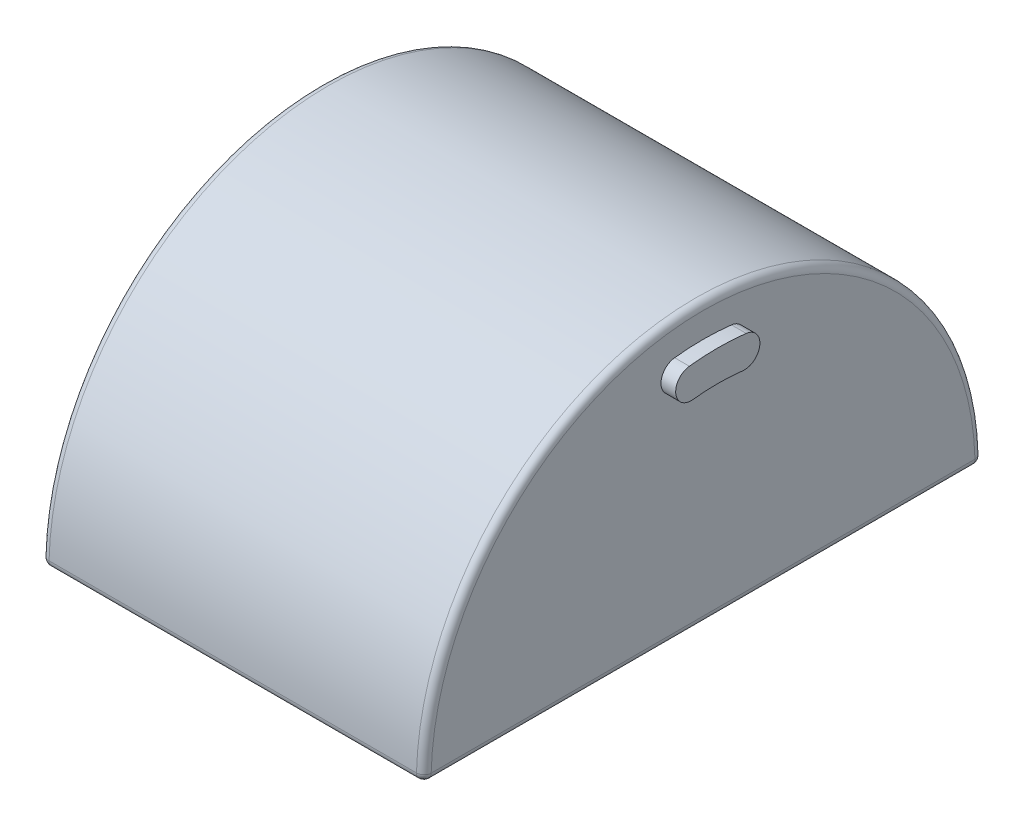
ISO-10303-21;
HEADER;
FILE_DESCRIPTION(('STEP AP214'),'2;1');
FILE_NAME('part.step','',(''),(''),'','','');
FILE_SCHEMA(('AUTOMOTIVE_DESIGN { 1 0 10303 214 1 1 1 1 }'));
ENDSEC;
DATA;
#1=APPLICATION_CONTEXT('core data for automotive mechanical design processes');
#2=APPLICATION_PROTOCOL_DEFINITION('international standard','automotive_design',2000,#1);
#3=PRODUCT_CONTEXT('',#1,'mechanical');
#4=PRODUCT('Part','Part','',(#3));
#5=PRODUCT_RELATED_PRODUCT_CATEGORY('part','',(#4));
#6=PRODUCT_DEFINITION_FORMATION('','',#4);
#7=PRODUCT_DEFINITION_CONTEXT('part definition',#1,'design');
#8=PRODUCT_DEFINITION('design','',#6,#7);
#9=PRODUCT_DEFINITION_SHAPE('','',#8);
#10=(LENGTH_UNIT() NAMED_UNIT(*) SI_UNIT(.MILLI.,.METRE.));
#11=(NAMED_UNIT(*) PLANE_ANGLE_UNIT() SI_UNIT($,.RADIAN.));
#12=(NAMED_UNIT(*) SI_UNIT($,.STERADIAN.) SOLID_ANGLE_UNIT());
#13=UNCERTAINTY_MEASURE_WITH_UNIT(LENGTH_MEASURE(1.E-05),#10,'distance_accuracy_value','');
#14=(GEOMETRIC_REPRESENTATION_CONTEXT(3) GLOBAL_UNCERTAINTY_ASSIGNED_CONTEXT((#13)) GLOBAL_UNIT_ASSIGNED_CONTEXT((#10,
#11,#12)) REPRESENTATION_CONTEXT('',''));
#15=CARTESIAN_POINT('',(0.,0.,0.));
#16=DIRECTION('',(0.,0.,1.));
#17=DIRECTION('',(1.,0.,0.));
#18=AXIS2_PLACEMENT_3D('',#15,#16,#17);
#19=CARTESIAN_POINT('',(-17.78,3.95516952522712E-13,0.));
#20=DIRECTION('',(1.,0.,0.));
#21=DIRECTION('',(0.,0.,-1.));
#22=AXIS2_PLACEMENT_3D('',#19,#20,#21);
#23=CYLINDRICAL_SURFACE('',#22,18.6773538171098);
#24=CARTESIAN_POINT('',(-16.51,3.95516952522712E-13,0.));
#25=DIRECTION('',(1.,0.,0.));
#26=DIRECTION('',(0.,0.,-1.));
#27=AXIS2_PLACEMENT_3D('',#24,#25,#26);
#28=CIRCLE('',#27,18.6773538171098);
#29=CARTESIAN_POINT('',(-16.51,18.5531588532219,-2.15031211144726));
#30=VERTEX_POINT('',#29);
#31=CARTESIAN_POINT('',(-16.51,18.5531588532219,2.15031211144719));
#32=VERTEX_POINT('',#31);
#33=EDGE_CURVE('E108',#30,#32,#28,.T.);
#34=ORIENTED_EDGE('',*,*,#33,.T.);
#35=DIRECTION('',(1.,0.,0.));
#36=VECTOR('',#35,1.);
#37=CARTESIAN_POINT('',(-17.78,18.5531588532219,2.15031211144719));
#38=LINE('',#37,#36);
#39=CARTESIAN_POINT('',(-17.78,18.5531588532219,2.15031211144719));
#40=VERTEX_POINT('',#39);
#41=EDGE_CURVE('E12',#40,#32,#38,.T.);
#42=ORIENTED_EDGE('',*,*,#41,.F.);
#43=CARTESIAN_POINT('',(-17.78,3.95516952522712E-13,0.));
#44=DIRECTION('',(1.,0.,0.));
#45=DIRECTION('',(0.,0.,-1.));
#46=AXIS2_PLACEMENT_3D('',#43,#44,#45);
#47=CIRCLE('',#46,18.6773538171098);
#48=CARTESIAN_POINT('',(-17.78,18.5531588532219,-2.15031211144726));
#49=VERTEX_POINT('',#48);
#50=EDGE_CURVE('E85',#49,#40,#47,.T.);
#51=ORIENTED_EDGE('',*,*,#50,.F.);
#52=DIRECTION('',(1.,0.,0.));
#53=VECTOR('',#52,1.);
#54=CARTESIAN_POINT('',(-17.78,18.5531588532219,-2.15031211144726));
#55=LINE('',#54,#53);
#56=EDGE_CURVE('E61',#49,#30,#55,.T.);
#57=ORIENTED_EDGE('',*,*,#56,.T.);
#58=EDGE_LOOP('',(#34,#42,#51,#57));
#59=FACE_BOUND('',#58,.T.);
#60=ADVANCED_FACE('F45',(#59),#23,.F.);
#61=CARTESIAN_POINT('',(-17.78,19.8777917521343,2.30383713585338));
#62=DIRECTION('',(1.,0.,0.));
#63=DIRECTION('',(0.,0.,-1.));
#64=AXIS2_PLACEMENT_3D('',#61,#62,#63);
#65=CYLINDRICAL_SURFACE('',#64,1.3335);
#66=CARTESIAN_POINT('',(-16.51,19.8777917521343,2.30383713585338));
#67=DIRECTION('',(1.,0.,0.));
#68=DIRECTION('',(0.,0.,-1.));
#69=AXIS2_PLACEMENT_3D('',#66,#67,#68);
#70=CIRCLE('',#69,1.3335);
#71=CARTESIAN_POINT('',(-16.51,21.2024246510467,2.45736216025957));
#72=VERTEX_POINT('',#71);
#73=EDGE_CURVE('E94',#72,#32,#70,.T.);
#74=ORIENTED_EDGE('',*,*,#73,.F.);
#75=DIRECTION('',(1.,0.,0.));
#76=VECTOR('',#75,1.);
#77=CARTESIAN_POINT('',(-17.78,21.2024246510467,2.45736216025957));
#78=LINE('',#77,#76);
#79=CARTESIAN_POINT('',(-17.78,21.2024246510467,2.45736216025957));
#80=VERTEX_POINT('',#79);
#81=EDGE_CURVE('E53',#80,#72,#78,.T.);
#82=ORIENTED_EDGE('',*,*,#81,.F.);
#83=CARTESIAN_POINT('',(-17.78,19.8777917521343,2.30383713585338));
#84=DIRECTION('',(1.,0.,0.));
#85=DIRECTION('',(0.,0.,-1.));
#86=AXIS2_PLACEMENT_3D('',#83,#84,#85);
#87=CIRCLE('',#86,1.3335);
#88=EDGE_CURVE('E92',#80,#40,#87,.T.);
#89=ORIENTED_EDGE('',*,*,#88,.T.);
#90=ORIENTED_EDGE('',*,*,#41,.T.);
#91=EDGE_LOOP('',(#74,#82,#89,#90));
#92=FACE_BOUND('',#91,.T.);
#93=ADVANCED_FACE('F91',(#92),#65,.T.);
#94=CARTESIAN_POINT('',(-17.78,3.95516952522712E-13,0.));
#95=DIRECTION('',(1.,0.,0.));
#96=DIRECTION('',(0.,0.,-1.));
#97=AXIS2_PLACEMENT_3D('',#94,#95,#96);
#98=CYLINDRICAL_SURFACE('',#97,21.3443538171098);
#99=CARTESIAN_POINT('',(-16.51,3.95516952522712E-13,0.));
#100=DIRECTION('',(1.,0.,0.));
#101=DIRECTION('',(0.,0.,-1.));
#102=AXIS2_PLACEMENT_3D('',#99,#100,#101);
#103=CIRCLE('',#102,21.3443538171098);
#104=CARTESIAN_POINT('',(-16.51,21.2024246510467,-2.45736216025964));
#105=VERTEX_POINT('',#104);
#106=EDGE_CURVE('E111',#105,#72,#103,.T.);
#107=ORIENTED_EDGE('',*,*,#106,.F.);
#108=DIRECTION('',(1.,0.,0.));
#109=VECTOR('',#108,1.);
#110=CARTESIAN_POINT('',(-17.78,21.2024246510467,-2.45736216025964));
#111=LINE('',#110,#109);
#112=CARTESIAN_POINT('',(-17.78,21.2024246510467,-2.45736216025964));
#113=VERTEX_POINT('',#112);
#114=EDGE_CURVE('E74',#113,#105,#111,.T.);
#115=ORIENTED_EDGE('',*,*,#114,.F.);
#116=CARTESIAN_POINT('',(-17.78,3.95516952522712E-13,0.));
#117=DIRECTION('',(1.,0.,0.));
#118=DIRECTION('',(0.,0.,-1.));
#119=AXIS2_PLACEMENT_3D('',#116,#117,#118);
#120=CIRCLE('',#119,21.3443538171098);
#121=EDGE_CURVE('E100',#113,#80,#120,.T.);
#122=ORIENTED_EDGE('',*,*,#121,.T.);
#123=ORIENTED_EDGE('',*,*,#81,.T.);
#124=EDGE_LOOP('',(#107,#115,#122,#123));
#125=FACE_BOUND('',#124,.T.);
#126=ADVANCED_FACE('F102',(#125),#98,.T.);
#127=CARTESIAN_POINT('',(-17.78,19.8777917521343,-2.30383713585345));
#128=DIRECTION('',(1.,0.,0.));
#129=DIRECTION('',(0.,0.,-1.));
#130=AXIS2_PLACEMENT_3D('',#127,#128,#129);
#131=CYLINDRICAL_SURFACE('',#130,1.3335);
#132=CARTESIAN_POINT('',(-16.51,19.8777917521343,-2.30383713585345));
#133=DIRECTION('',(1.,0.,0.));
#134=DIRECTION('',(0.,0.,-1.));
#135=AXIS2_PLACEMENT_3D('',#132,#133,#134);
#136=CIRCLE('',#135,1.3335);
#137=EDGE_CURVE('E113',#30,#105,#136,.T.);
#138=ORIENTED_EDGE('',*,*,#137,.F.);
#139=ORIENTED_EDGE('',*,*,#56,.F.);
#140=CARTESIAN_POINT('',(-17.78,19.8777917521343,-2.30383713585345));
#141=DIRECTION('',(1.,0.,0.));
#142=DIRECTION('',(0.,0.,-1.));
#143=AXIS2_PLACEMENT_3D('',#140,#141,#142);
#144=CIRCLE('',#143,1.3335);
#145=EDGE_CURVE('E103',#49,#113,#144,.T.);
#146=ORIENTED_EDGE('',*,*,#145,.T.);
#147=ORIENTED_EDGE('',*,*,#114,.T.);
#148=EDGE_LOOP('',(#138,#139,#146,#147));
#149=FACE_BOUND('',#148,.T.);
#150=ADVANCED_FACE('F119',(#149),#131,.T.);
#151=CARTESIAN_POINT('',(-17.78,9.93889587606735,1.1519185679267));
#152=DIRECTION('',(1.,0.,0.));
#153=DIRECTION('',(0.,0.,-1.));
#154=AXIS2_PLACEMENT_3D('',#151,#152,#153);
#155=PLANE('',#154);
#156=ORIENTED_EDGE('',*,*,#50,.T.);
#157=ORIENTED_EDGE('',*,*,#88,.F.);
#158=ORIENTED_EDGE('',*,*,#121,.F.);
#159=ORIENTED_EDGE('',*,*,#145,.F.);
#160=EDGE_LOOP('',(#156,#157,#158,#159));
#161=FACE_BOUND('',#160,.T.);
#162=ADVANCED_FACE('F99',(#161),#155,.F.);
#163=CARTESIAN_POINT('',(-16.51,9.93889587606735,1.1519185679267));
#164=DIRECTION('',(1.,0.,0.));
#165=DIRECTION('',(0.,0.,-1.));
#166=AXIS2_PLACEMENT_3D('',#163,#164,#165);
#167=PLANE('',#166);
#168=ORIENTED_EDGE('',*,*,#33,.F.);
#169=ORIENTED_EDGE('',*,*,#137,.T.);
#170=ORIENTED_EDGE('',*,*,#106,.T.);
#171=ORIENTED_EDGE('',*,*,#73,.T.);
#172=EDGE_LOOP('',(#168,#169,#170,#171));
#173=FACE_BOUND('',#172,.T.);
#174=ADVANCED_FACE('F118',(#173),#167,.T.);
#175=CLOSED_SHELL('',(#60,#93,#126,#150,#162,#174));
#176=MANIFOLD_SOLID_BREP('B2',#175);
#177=CARTESIAN_POINT('',(17.78,3.95516952522712E-13,0.));
#178=DIRECTION('',(-1.,0.,0.));
#179=DIRECTION('',(0.,0.,1.));
#180=AXIS2_PLACEMENT_3D('',#177,#178,#179);
#181=CYLINDRICAL_SURFACE('',#180,18.6773538171098);
#182=CARTESIAN_POINT('',(16.51,3.95516952522712E-13,0.));
#183=DIRECTION('',(1.,0.,0.));
#184=DIRECTION('',(0.,0.,-1.));
#185=AXIS2_PLACEMENT_3D('',#182,#183,#184);
#186=CIRCLE('',#185,18.6773538171098);
#187=CARTESIAN_POINT('',(16.51,18.5531588532219,-2.15031211144726));
#188=VERTEX_POINT('',#187);
#189=CARTESIAN_POINT('',(16.51,18.5531588532219,2.15031211144719));
#190=VERTEX_POINT('',#189);
#191=EDGE_CURVE('E242',#188,#190,#186,.T.);
#192=ORIENTED_EDGE('',*,*,#191,.F.);
#193=DIRECTION('',(-1.,0.,0.));
#194=VECTOR('',#193,1.);
#195=CARTESIAN_POINT('',(17.78,18.5531588532219,-2.15031211144726));
#196=LINE('',#195,#194);
#197=CARTESIAN_POINT('',(17.78,18.5531588532219,-2.15031211144726));
#198=VERTEX_POINT('',#197);
#199=EDGE_CURVE('E43',#198,#188,#196,.T.);
#200=ORIENTED_EDGE('',*,*,#199,.F.);
#201=CARTESIAN_POINT('',(17.78,3.95516952522712E-13,0.));
#202=DIRECTION('',(1.,0.,0.));
#203=DIRECTION('',(0.,0.,-1.));
#204=AXIS2_PLACEMENT_3D('',#201,#202,#203);
#205=CIRCLE('',#204,18.6773538171098);
#206=CARTESIAN_POINT('',(17.78,18.5531588532219,2.15031211144719));
#207=VERTEX_POINT('',#206);
#208=EDGE_CURVE('E237',#198,#207,#205,.T.);
#209=ORIENTED_EDGE('',*,*,#208,.T.);
#210=DIRECTION('',(-1.,0.,0.));
#211=VECTOR('',#210,1.);
#212=CARTESIAN_POINT('',(17.78,18.5531588532219,2.15031211144719));
#213=LINE('',#212,#211);
#214=EDGE_CURVE('E180',#207,#190,#213,.T.);
#215=ORIENTED_EDGE('',*,*,#214,.T.);
#216=EDGE_LOOP('',(#192,#200,#209,#215));
#217=FACE_BOUND('',#216,.T.);
#218=ADVANCED_FACE('F177',(#217),#181,.F.);
#219=CARTESIAN_POINT('',(17.78,19.8777917521343,-2.30383713585345));
#220=DIRECTION('',(-1.,0.,0.));
#221=DIRECTION('',(0.,0.,1.));
#222=AXIS2_PLACEMENT_3D('',#219,#220,#221);
#223=CYLINDRICAL_SURFACE('',#222,1.3335);
#224=CARTESIAN_POINT('',(16.51,19.8777917521343,-2.30383713585345));
#225=DIRECTION('',(1.,0.,0.));
#226=DIRECTION('',(0.,0.,-1.));
#227=AXIS2_PLACEMENT_3D('',#224,#225,#226);
#228=CIRCLE('',#227,1.3335);
#229=CARTESIAN_POINT('',(16.51,21.2024246510467,-2.45736216025964));
#230=VERTEX_POINT('',#229);
#231=EDGE_CURVE('E210',#188,#230,#228,.T.);
#232=ORIENTED_EDGE('',*,*,#231,.T.);
#233=DIRECTION('',(-1.,0.,0.));
#234=VECTOR('',#233,1.);
#235=CARTESIAN_POINT('',(17.78,21.2024246510467,-2.45736216025964));
#236=LINE('',#235,#234);
#237=CARTESIAN_POINT('',(17.78,21.2024246510467,-2.45736216025964));
#238=VERTEX_POINT('',#237);
#239=EDGE_CURVE('E186',#238,#230,#236,.T.);
#240=ORIENTED_EDGE('',*,*,#239,.F.);
#241=CARTESIAN_POINT('',(17.78,19.8777917521343,-2.30383713585345));
#242=DIRECTION('',(1.,0.,0.));
#243=DIRECTION('',(0.,0.,-1.));
#244=AXIS2_PLACEMENT_3D('',#241,#242,#243);
#245=CIRCLE('',#244,1.3335);
#246=EDGE_CURVE('E225',#198,#238,#245,.T.);
#247=ORIENTED_EDGE('',*,*,#246,.F.);
#248=ORIENTED_EDGE('',*,*,#199,.T.);
#249=EDGE_LOOP('',(#232,#240,#247,#248));
#250=FACE_BOUND('',#249,.T.);
#251=ADVANCED_FACE('F252',(#250),#223,.T.);
#252=CARTESIAN_POINT('',(17.78,3.95516952522712E-13,0.));
#253=DIRECTION('',(-1.,0.,0.));
#254=DIRECTION('',(0.,0.,1.));
#255=AXIS2_PLACEMENT_3D('',#252,#253,#254);
#256=CYLINDRICAL_SURFACE('',#255,21.3443538171098);
#257=CARTESIAN_POINT('',(16.51,3.95516952522712E-13,0.));
#258=DIRECTION('',(1.,0.,0.));
#259=DIRECTION('',(0.,0.,-1.));
#260=AXIS2_PLACEMENT_3D('',#257,#258,#259);
#261=CIRCLE('',#260,21.3443538171098);
#262=CARTESIAN_POINT('',(16.51,21.2024246510467,2.45736216025957));
#263=VERTEX_POINT('',#262);
#264=EDGE_CURVE('E232',#230,#263,#261,.T.);
#265=ORIENTED_EDGE('',*,*,#264,.T.);
#266=DIRECTION('',(-1.,0.,0.));
#267=VECTOR('',#266,1.);
#268=CARTESIAN_POINT('',(17.78,21.2024246510467,2.45736216025957));
#269=LINE('',#268,#267);
#270=CARTESIAN_POINT('',(17.78,21.2024246510467,2.45736216025957));
#271=VERTEX_POINT('',#270);
#272=EDGE_CURVE('E229',#271,#263,#269,.T.);
#273=ORIENTED_EDGE('',*,*,#272,.F.);
#274=CARTESIAN_POINT('',(17.78,3.95516952522712E-13,0.));
#275=DIRECTION('',(1.,0.,0.));
#276=DIRECTION('',(0.,0.,-1.));
#277=AXIS2_PLACEMENT_3D('',#274,#275,#276);
#278=CIRCLE('',#277,21.3443538171098);
#279=EDGE_CURVE('E222',#238,#271,#278,.T.);
#280=ORIENTED_EDGE('',*,*,#279,.F.);
#281=ORIENTED_EDGE('',*,*,#239,.T.);
#282=EDGE_LOOP('',(#265,#273,#280,#281));
#283=FACE_BOUND('',#282,.T.);
#284=ADVANCED_FACE('F230',(#283),#256,.T.);
#285=CARTESIAN_POINT('',(17.78,19.8777917521343,2.30383713585338));
#286=DIRECTION('',(-1.,0.,0.));
#287=DIRECTION('',(0.,0.,1.));
#288=AXIS2_PLACEMENT_3D('',#285,#286,#287);
#289=CYLINDRICAL_SURFACE('',#288,1.3335);
#290=CARTESIAN_POINT('',(16.51,19.8777917521343,2.30383713585338));
#291=DIRECTION('',(1.,0.,0.));
#292=DIRECTION('',(0.,0.,-1.));
#293=AXIS2_PLACEMENT_3D('',#290,#291,#292);
#294=CIRCLE('',#293,1.3335);
#295=EDGE_CURVE('E245',#263,#190,#294,.T.);
#296=ORIENTED_EDGE('',*,*,#295,.T.);
#297=ORIENTED_EDGE('',*,*,#214,.F.);
#298=CARTESIAN_POINT('',(17.78,19.8777917521343,2.30383713585338));
#299=DIRECTION('',(1.,0.,0.));
#300=DIRECTION('',(0.,0.,-1.));
#301=AXIS2_PLACEMENT_3D('',#298,#299,#300);
#302=CIRCLE('',#301,1.3335);
#303=EDGE_CURVE('E219',#271,#207,#302,.T.);
#304=ORIENTED_EDGE('',*,*,#303,.F.);
#305=ORIENTED_EDGE('',*,*,#272,.T.);
#306=EDGE_LOOP('',(#296,#297,#304,#305));
#307=FACE_BOUND('',#306,.T.);
#308=ADVANCED_FACE('F236',(#307),#289,.T.);
#309=CARTESIAN_POINT('',(17.78,9.93889587606735,1.1519185679267));
#310=DIRECTION('',(1.,0.,0.));
#311=DIRECTION('',(0.,0.,-1.));
#312=AXIS2_PLACEMENT_3D('',#309,#310,#311);
#313=PLANE('',#312);
#314=ORIENTED_EDGE('',*,*,#208,.F.);
#315=ORIENTED_EDGE('',*,*,#246,.T.);
#316=ORIENTED_EDGE('',*,*,#279,.T.);
#317=ORIENTED_EDGE('',*,*,#303,.T.);
#318=EDGE_LOOP('',(#314,#315,#316,#317));
#319=FACE_BOUND('',#318,.T.);
#320=ADVANCED_FACE('F224',(#319),#313,.T.);
#321=CARTESIAN_POINT('',(16.51,9.93889587606735,1.1519185679267));
#322=DIRECTION('',(1.,0.,0.));
#323=DIRECTION('',(0.,0.,-1.));
#324=AXIS2_PLACEMENT_3D('',#321,#322,#323);
#325=PLANE('',#324);
#326=ORIENTED_EDGE('',*,*,#191,.T.);
#327=ORIENTED_EDGE('',*,*,#295,.F.);
#328=ORIENTED_EDGE('',*,*,#264,.F.);
#329=ORIENTED_EDGE('',*,*,#231,.F.);
#330=EDGE_LOOP('',(#326,#327,#328,#329));
#331=FACE_BOUND('',#330,.T.);
#332=ADVANCED_FACE('F250',(#331),#325,.F.);
#333=CLOSED_SHELL('',(#218,#251,#284,#308,#320,#332));
#334=MANIFOLD_SOLID_BREP('B6',#333);
#335=CARTESIAN_POINT('',(16.51,0.,0.));
#336=DIRECTION('',(0.,1.,0.));
#337=DIRECTION('',(0.,0.,1.));
#338=AXIS2_PLACEMENT_3D('',#335,#336,#337);
#339=PLANE('',#338);
#340=DIRECTION('',(0.,0.,-1.));
#341=VECTOR('',#340,1.);
#342=CARTESIAN_POINT('',(-15.875,0.,0.));
#343=LINE('',#342,#341);
#344=CARTESIAN_POINT('',(-15.875,0.,23.4947742200744));
#345=VERTEX_POINT('',#344);
#346=CARTESIAN_POINT('',(-15.875,0.,-23.4947742200744));
#347=VERTEX_POINT('',#346);
#348=EDGE_CURVE('E547',#345,#347,#343,.T.);
#349=ORIENTED_EDGE('',*,*,#348,.T.);
#350=DIRECTION('',(-1.,0.,0.));
#351=VECTOR('',#350,1.);
#352=CARTESIAN_POINT('',(16.51,0.,-23.4947742200744));
#353=LINE('',#352,#351);
#354=CARTESIAN_POINT('',(15.875,0.,-23.4947742200744));
#355=VERTEX_POINT('',#354);
#356=EDGE_CURVE('E549',#347,#355,#353,.F.);
#357=ORIENTED_EDGE('',*,*,#356,.T.);
#358=DIRECTION('',(0.,0.,-1.));
#359=VECTOR('',#358,1.);
#360=CARTESIAN_POINT('',(15.875,0.,24.1383538171102));
#361=LINE('',#360,#359);
#362=CARTESIAN_POINT('',(15.875,0.,23.4947742200744));
#363=VERTEX_POINT('',#362);
#364=EDGE_CURVE('E545',#355,#363,#361,.F.);
#365=ORIENTED_EDGE('',*,*,#364,.T.);
#366=DIRECTION('',(-1.,0.,0.));
#367=VECTOR('',#366,1.);
#368=CARTESIAN_POINT('',(16.51,0.,23.4947742200744));
#369=LINE('',#368,#367);
#370=EDGE_CURVE('E543',#363,#345,#369,.T.);
#371=ORIENTED_EDGE('',*,*,#370,.T.);
#372=EDGE_LOOP('',(#349,#357,#365,#371));
#373=FACE_BOUND('',#372,.T.);
#374=DIRECTION('',(0.,0.,1.));
#375=VECTOR('',#374,1.);
#376=CARTESIAN_POINT('',(-8.636,0.,-16.51));
#377=LINE('',#376,#375);
#378=CARTESIAN_POINT('',(-8.636,0.,-16.51));
#379=VERTEX_POINT('',#378);
#380=CARTESIAN_POINT('',(-8.636,0.,-15.24));
#381=VERTEX_POINT('',#380);
#382=EDGE_CURVE('E474',#379,#381,#377,.T.);
#383=ORIENTED_EDGE('',*,*,#382,.F.);
#384=DIRECTION('',(1.,0.,0.));
#385=VECTOR('',#384,1.);
#386=CARTESIAN_POINT('',(0.,0.,-16.51));
#387=LINE('',#386,#385);
#388=CARTESIAN_POINT('',(-11.176,0.,-16.51));
#389=VERTEX_POINT('',#388);
#390=EDGE_CURVE('E457',#389,#379,#387,.T.);
#391=ORIENTED_EDGE('',*,*,#390,.F.);
#392=DIRECTION('',(0.,0.,1.));
#393=VECTOR('',#392,1.);
#394=CARTESIAN_POINT('',(-11.176,0.,-16.51));
#395=LINE('',#394,#393);
#396=CARTESIAN_POINT('',(-11.176,0.,-15.24));
#397=VERTEX_POINT('',#396);
#398=EDGE_CURVE('E606',#389,#397,#395,.T.);
#399=ORIENTED_EDGE('',*,*,#398,.T.);
#400=DIRECTION('',(1.,0.,0.));
#401=VECTOR('',#400,1.);
#402=CARTESIAN_POINT('',(0.,0.,-15.24));
#403=LINE('',#402,#401);
#404=CARTESIAN_POINT('',(-13.97,0.,-15.24));
#405=VERTEX_POINT('',#404);
#406=EDGE_CURVE('E477',#405,#397,#403,.T.);
#407=ORIENTED_EDGE('',*,*,#406,.F.);
#408=DIRECTION('',(0.,0.,1.));
#409=VECTOR('',#408,1.);
#410=CARTESIAN_POINT('',(-13.97,0.,-15.24));
#411=LINE('',#410,#409);
#412=CARTESIAN_POINT('',(-13.97,0.,15.24));
#413=VERTEX_POINT('',#412);
#414=EDGE_CURVE('E493',#405,#413,#411,.T.);
#415=ORIENTED_EDGE('',*,*,#414,.T.);
#416=DIRECTION('',(1.,0.,0.));
#417=VECTOR('',#416,1.);
#418=CARTESIAN_POINT('',(0.,0.,15.24));
#419=LINE('',#418,#417);
#420=CARTESIAN_POINT('',(-11.176,0.,15.24));
#421=VERTEX_POINT('',#420);
#422=EDGE_CURVE('E486',#413,#421,#419,.T.);
#423=ORIENTED_EDGE('',*,*,#422,.T.);
#424=CARTESIAN_POINT('',(-11.176,0.,16.51));
#425=VERTEX_POINT('',#424);
#426=EDGE_CURVE('E608',#421,#425,#395,.T.);
#427=ORIENTED_EDGE('',*,*,#426,.T.);
#428=DIRECTION('',(1.,0.,0.));
#429=VECTOR('',#428,1.);
#430=CARTESIAN_POINT('',(0.,0.,16.51));
#431=LINE('',#430,#429);
#432=CARTESIAN_POINT('',(-8.636,0.,16.51));
#433=VERTEX_POINT('',#432);
#434=EDGE_CURVE('E459',#425,#433,#431,.T.);
#435=ORIENTED_EDGE('',*,*,#434,.T.);
#436=CARTESIAN_POINT('',(-8.636,0.,15.24));
#437=VERTEX_POINT('',#436);
#438=EDGE_CURVE('E605',#437,#433,#377,.T.);
#439=ORIENTED_EDGE('',*,*,#438,.F.);
#440=CARTESIAN_POINT('',(8.636,0.,15.24));
#441=VERTEX_POINT('',#440);
#442=EDGE_CURVE('E490',#437,#441,#419,.T.);
#443=ORIENTED_EDGE('',*,*,#442,.T.);
#444=DIRECTION('',(0.,0.,1.));
#445=VECTOR('',#444,1.);
#446=CARTESIAN_POINT('',(8.636,0.,-16.51));
#447=LINE('',#446,#445);
#448=CARTESIAN_POINT('',(8.636,0.,16.51));
#449=VERTEX_POINT('',#448);
#450=EDGE_CURVE('E448',#441,#449,#447,.T.);
#451=ORIENTED_EDGE('',*,*,#450,.T.);
#452=CARTESIAN_POINT('',(11.176,0.,16.51));
#453=VERTEX_POINT('',#452);
#454=EDGE_CURVE('E595',#449,#453,#431,.T.);
#455=ORIENTED_EDGE('',*,*,#454,.T.);
#456=DIRECTION('',(0.,0.,1.));
#457=VECTOR('',#456,1.);
#458=CARTESIAN_POINT('',(11.176,0.,-16.51));
#459=LINE('',#458,#457);
#460=CARTESIAN_POINT('',(11.176,0.,15.24));
#461=VERTEX_POINT('',#460);
#462=EDGE_CURVE('E447',#461,#453,#459,.T.);
#463=ORIENTED_EDGE('',*,*,#462,.F.);
#464=CARTESIAN_POINT('',(13.97,0.,15.24));
#465=VERTEX_POINT('',#464);
#466=EDGE_CURVE('E476',#461,#465,#419,.T.);
#467=ORIENTED_EDGE('',*,*,#466,.T.);
#468=DIRECTION('',(0.,0.,1.));
#469=VECTOR('',#468,1.);
#470=CARTESIAN_POINT('',(13.97,0.,-15.24));
#471=LINE('',#470,#469);
#472=CARTESIAN_POINT('',(13.97,0.,-15.24));
#473=VERTEX_POINT('',#472);
#474=EDGE_CURVE('E485',#473,#465,#471,.T.);
#475=ORIENTED_EDGE('',*,*,#474,.F.);
#476=CARTESIAN_POINT('',(11.176,0.,-15.24));
#477=VERTEX_POINT('',#476);
#478=EDGE_CURVE('E482',#477,#473,#403,.T.);
#479=ORIENTED_EDGE('',*,*,#478,.F.);
#480=CARTESIAN_POINT('',(11.176,0.,-16.51));
#481=VERTEX_POINT('',#480);
#482=EDGE_CURVE('E462',#481,#477,#459,.T.);
#483=ORIENTED_EDGE('',*,*,#482,.F.);
#484=CARTESIAN_POINT('',(8.636,0.,-16.51));
#485=VERTEX_POINT('',#484);
#486=EDGE_CURVE('E454',#485,#481,#387,.T.);
#487=ORIENTED_EDGE('',*,*,#486,.F.);
#488=CARTESIAN_POINT('',(8.636,0.,-15.24));
#489=VERTEX_POINT('',#488);
#490=EDGE_CURVE('E436',#485,#489,#447,.T.);
#491=ORIENTED_EDGE('',*,*,#490,.T.);
#492=EDGE_CURVE('E481',#381,#489,#403,.T.);
#493=ORIENTED_EDGE('',*,*,#492,.F.);
#494=EDGE_LOOP('',(#383,#391,#399,#407,#415,#423,#427,#435,#439,#443,#451,#455,#463,#467,#475,
#479,#483,#487,#491,#493));
#495=FACE_BOUND('',#494,.T.);
#496=ADVANCED_FACE('F300',(#373,#495),#339,.F.);
#497=CARTESIAN_POINT('',(0.,0.,-15.24));
#498=DIRECTION('',(0.,0.,1.));
#499=DIRECTION('',(1.,0.,0.));
#500=AXIS2_PLACEMENT_3D('',#497,#498,#499);
#501=PLANE('',#500);
#502=ORIENTED_EDGE('',*,*,#492,.T.);
#503=CARTESIAN_POINT('',(0.,0.,-15.24));
#504=DIRECTION('',(0.,0.,1.));
#505=DIRECTION('',(1.,0.,0.));
#506=AXIS2_PLACEMENT_3D('',#503,#504,#505);
#507=CIRCLE('',#506,8.636);
#508=EDGE_CURVE('E442',#489,#381,#507,.T.);
#509=ORIENTED_EDGE('',*,*,#508,.T.);
#510=EDGE_LOOP('',(#502,#509));
#511=FACE_BOUND('',#510,.T.);
#512=ADVANCED_FACE('F635',(#511),#501,.T.);
#513=CARTESIAN_POINT('',(0.,0.,15.24));
#514=DIRECTION('',(0.,0.,1.));
#515=DIRECTION('',(1.,0.,0.));
#516=AXIS2_PLACEMENT_3D('',#513,#514,#515);
#517=PLANE('',#516);
#518=CARTESIAN_POINT('',(0.,0.,15.24));
#519=DIRECTION('',(0.,0.,1.));
#520=DIRECTION('',(1.,0.,0.));
#521=AXIS2_PLACEMENT_3D('',#518,#519,#520);
#522=CIRCLE('',#521,8.636);
#523=EDGE_CURVE('E532',#441,#437,#522,.T.);
#524=ORIENTED_EDGE('',*,*,#523,.F.);
#525=ORIENTED_EDGE('',*,*,#442,.F.);
#526=EDGE_LOOP('',(#524,#525));
#527=FACE_BOUND('',#526,.T.);
#528=ADVANCED_FACE('F624',(#527),#517,.F.);
#529=CARTESIAN_POINT('',(16.51,0.,0.));
#530=DIRECTION('',(-1.,0.,0.));
#531=DIRECTION('',(0.,0.,1.));
#532=AXIS2_PLACEMENT_3D('',#529,#530,#531);
#533=CYLINDRICAL_SURFACE('',#532,24.1383538171102);
#534=CARTESIAN_POINT('',(15.875,0.,0.));
#535=DIRECTION('',(1.,0.,0.));
#536=DIRECTION('',(0.,0.,-1.));
#537=AXIS2_PLACEMENT_3D('',#534,#535,#536);
#538=CIRCLE('',#537,24.1383538171102);
#539=CARTESIAN_POINT('',(15.875,0.652156062200215,24.129542421491));
#540=VERTEX_POINT('',#539);
#541=CARTESIAN_POINT('',(15.875,0.652156062200215,-24.129542421491));
#542=VERTEX_POINT('',#541);
#543=EDGE_CURVE('E536',#540,#542,#538,.F.);
#544=ORIENTED_EDGE('',*,*,#543,.T.);
#545=DIRECTION('',(-1.,0.,0.));
#546=VECTOR('',#545,1.);
#547=CARTESIAN_POINT('',(16.51,0.652156062200215,-24.129542421491));
#548=LINE('',#547,#546);
#549=CARTESIAN_POINT('',(-15.875,0.652156062200215,-24.129542421491));
#550=VERTEX_POINT('',#549);
#551=EDGE_CURVE('E540',#542,#550,#548,.T.);
#552=ORIENTED_EDGE('',*,*,#551,.T.);
#553=CARTESIAN_POINT('',(-15.875,0.,0.));
#554=DIRECTION('',(1.,0.,0.));
#555=DIRECTION('',(0.,0.,-1.));
#556=AXIS2_PLACEMENT_3D('',#553,#554,#555);
#557=CIRCLE('',#556,24.1383538171102);
#558=CARTESIAN_POINT('',(-15.875,0.652156062200215,24.129542421491));
#559=VERTEX_POINT('',#558);
#560=EDGE_CURVE('E538',#550,#559,#557,.T.);
#561=ORIENTED_EDGE('',*,*,#560,.T.);
#562=DIRECTION('',(-1.,0.,0.));
#563=VECTOR('',#562,1.);
#564=CARTESIAN_POINT('',(16.51,0.652156062200215,24.129542421491));
#565=LINE('',#564,#563);
#566=EDGE_CURVE('E534',#559,#540,#565,.F.);
#567=ORIENTED_EDGE('',*,*,#566,.T.);
#568=EDGE_LOOP('',(#544,#552,#561,#567));
#569=FACE_BOUND('',#568,.T.);
#570=ADVANCED_FACE('F642',(#569),#533,.T.);
#571=CARTESIAN_POINT('',(16.51,19.8777917521343,2.30383713585338));
#572=DIRECTION('',(-1.,0.,0.));
#573=DIRECTION('',(0.,0.,1.));
#574=AXIS2_PLACEMENT_3D('',#571,#572,#573);
#575=CYLINDRICAL_SURFACE('',#574,1.3335);
#576=CARTESIAN_POINT('',(-16.51,19.8777917521343,2.30383713585338));
#577=DIRECTION('',(1.,0.,0.));
#578=DIRECTION('',(0.,0.,-1.));
#579=AXIS2_PLACEMENT_3D('',#576,#577,#578);
#580=CIRCLE('',#579,1.3335);
#581=CARTESIAN_POINT('',(-16.51,21.2024246510467,2.45736216025957));
#582=VERTEX_POINT('',#581);
#583=CARTESIAN_POINT('',(-16.51,18.5531588532219,2.15031211144719));
#584=VERTEX_POINT('',#583);
#585=EDGE_CURVE('E496',#582,#584,#580,.T.);
#586=ORIENTED_EDGE('',*,*,#585,.F.);
#587=DIRECTION('',(-1.,0.,0.));
#588=VECTOR('',#587,1.);
#589=CARTESIAN_POINT('',(16.51,21.2024246510467,2.45736216025957));
#590=LINE('',#589,#588);
#591=CARTESIAN_POINT('',(16.51,21.2024246510467,2.45736216025957));
#592=VERTEX_POINT('',#591);
#593=EDGE_CURVE('E527',#592,#582,#590,.T.);
#594=ORIENTED_EDGE('',*,*,#593,.F.);
#595=CARTESIAN_POINT('',(16.51,19.8777917521343,2.30383713585338));
#596=DIRECTION('',(1.,0.,0.));
#597=DIRECTION('',(0.,0.,-1.));
#598=AXIS2_PLACEMENT_3D('',#595,#596,#597);
#599=CIRCLE('',#598,1.3335);
#600=CARTESIAN_POINT('',(16.51,18.5531588532219,2.15031211144719));
#601=VERTEX_POINT('',#600);
#602=EDGE_CURVE('E499',#592,#601,#599,.T.);
#603=ORIENTED_EDGE('',*,*,#602,.T.);
#604=DIRECTION('',(-1.,0.,0.));
#605=VECTOR('',#604,1.);
#606=CARTESIAN_POINT('',(16.51,18.5531588532219,2.15031211144719));
#607=LINE('',#606,#605);
#608=EDGE_CURVE('E511',#601,#584,#607,.T.);
#609=ORIENTED_EDGE('',*,*,#608,.T.);
#610=EDGE_LOOP('',(#586,#594,#603,#609));
#611=FACE_BOUND('',#610,.T.);
#612=ADVANCED_FACE('F666',(#611),#575,.F.);
#613=CARTESIAN_POINT('',(16.51,3.95516952522712E-13,0.));
#614=DIRECTION('',(-1.,0.,0.));
#615=DIRECTION('',(0.,0.,1.));
#616=AXIS2_PLACEMENT_3D('',#613,#614,#615);
#617=CYLINDRICAL_SURFACE('',#616,21.3443538171098);
#618=CARTESIAN_POINT('',(-16.51,3.95516952522712E-13,0.));
#619=DIRECTION('',(1.,0.,0.));
#620=DIRECTION('',(0.,0.,-1.));
#621=AXIS2_PLACEMENT_3D('',#618,#619,#620);
#622=CIRCLE('',#621,21.3443538171098);
#623=CARTESIAN_POINT('',(-16.51,21.2024246510467,-2.45736216025964));
#624=VERTEX_POINT('',#623);
#625=EDGE_CURVE('E514',#624,#582,#622,.T.);
#626=ORIENTED_EDGE('',*,*,#625,.F.);
#627=DIRECTION('',(-1.,0.,0.));
#628=VECTOR('',#627,1.);
#629=CARTESIAN_POINT('',(16.51,21.2024246510467,-2.45736216025964));
#630=LINE('',#629,#628);
#631=CARTESIAN_POINT('',(16.51,21.2024246510467,-2.45736216025964));
#632=VERTEX_POINT('',#631);
#633=EDGE_CURVE('E525',#632,#624,#630,.T.);
#634=ORIENTED_EDGE('',*,*,#633,.F.);
#635=CARTESIAN_POINT('',(16.51,3.95516952522712E-13,0.));
#636=DIRECTION('',(1.,0.,0.));
#637=DIRECTION('',(0.,0.,-1.));
#638=AXIS2_PLACEMENT_3D('',#635,#636,#637);
#639=CIRCLE('',#638,21.3443538171098);
#640=EDGE_CURVE('E502',#632,#592,#639,.T.);
#641=ORIENTED_EDGE('',*,*,#640,.T.);
#642=ORIENTED_EDGE('',*,*,#593,.T.);
#643=EDGE_LOOP('',(#626,#634,#641,#642));
#644=FACE_BOUND('',#643,.T.);
#645=ADVANCED_FACE('F674',(#644),#617,.F.);
#646=CARTESIAN_POINT('',(16.51,19.8777917521343,-2.30383713585345));
#647=DIRECTION('',(-1.,0.,0.));
#648=DIRECTION('',(0.,0.,1.));
#649=AXIS2_PLACEMENT_3D('',#646,#647,#648);
#650=CYLINDRICAL_SURFACE('',#649,1.3335);
#651=CARTESIAN_POINT('',(-16.51,19.8777917521343,-2.30383713585345));
#652=DIRECTION('',(1.,0.,0.));
#653=DIRECTION('',(0.,0.,-1.));
#654=AXIS2_PLACEMENT_3D('',#651,#652,#653);
#655=CIRCLE('',#654,1.3335);
#656=CARTESIAN_POINT('',(-16.51,18.5531588532219,-2.15031211144726));
#657=VERTEX_POINT('',#656);
#658=EDGE_CURVE('E517',#657,#624,#655,.T.);
#659=ORIENTED_EDGE('',*,*,#658,.F.);
#660=DIRECTION('',(-1.,0.,0.));
#661=VECTOR('',#660,1.);
#662=CARTESIAN_POINT('',(16.51,18.5531588532219,-2.15031211144726));
#663=LINE('',#662,#661);
#664=CARTESIAN_POINT('',(16.51,18.5531588532219,-2.15031211144726));
#665=VERTEX_POINT('',#664);
#666=EDGE_CURVE('E523',#665,#657,#663,.T.);
#667=ORIENTED_EDGE('',*,*,#666,.F.);
#668=CARTESIAN_POINT('',(16.51,19.8777917521343,-2.30383713585345));
#669=DIRECTION('',(1.,0.,0.));
#670=DIRECTION('',(0.,0.,-1.));
#671=AXIS2_PLACEMENT_3D('',#668,#669,#670);
#672=CIRCLE('',#671,1.3335);
#673=EDGE_CURVE('E506',#665,#632,#672,.T.);
#674=ORIENTED_EDGE('',*,*,#673,.T.);
#675=ORIENTED_EDGE('',*,*,#633,.T.);
#676=EDGE_LOOP('',(#659,#667,#674,#675));
#677=FACE_BOUND('',#676,.T.);
#678=ADVANCED_FACE('F670',(#677),#650,.F.);
#679=CARTESIAN_POINT('',(16.51,3.95516952522712E-13,0.));
#680=DIRECTION('',(-1.,0.,0.));
#681=DIRECTION('',(0.,0.,1.));
#682=AXIS2_PLACEMENT_3D('',#679,#680,#681);
#683=CYLINDRICAL_SURFACE('',#682,18.6773538171098);
#684=CARTESIAN_POINT('',(-16.51,3.95516952522712E-13,0.));
#685=DIRECTION('',(1.,0.,0.));
#686=DIRECTION('',(0.,0.,-1.));
#687=AXIS2_PLACEMENT_3D('',#684,#685,#686);
#688=CIRCLE('',#687,18.6773538171098);
#689=EDGE_CURVE('E503',#657,#584,#688,.T.);
#690=ORIENTED_EDGE('',*,*,#689,.T.);
#691=ORIENTED_EDGE('',*,*,#608,.F.);
#692=CARTESIAN_POINT('',(16.51,3.95516952522712E-13,0.));
#693=DIRECTION('',(1.,0.,0.));
#694=DIRECTION('',(0.,0.,-1.));
#695=AXIS2_PLACEMENT_3D('',#692,#693,#694);
#696=CIRCLE('',#695,18.6773538171098);
#697=EDGE_CURVE('E509',#665,#601,#696,.T.);
#698=ORIENTED_EDGE('',*,*,#697,.F.);
#699=ORIENTED_EDGE('',*,*,#666,.T.);
#700=EDGE_LOOP('',(#690,#691,#698,#699));
#701=FACE_BOUND('',#700,.T.);
#702=ADVANCED_FACE('F662',(#701),#683,.T.);
#703=CARTESIAN_POINT('',(16.51,0.,0.));
#704=DIRECTION('',(1.,0.,0.));
#705=DIRECTION('',(0.,0.,-1.));
#706=AXIS2_PLACEMENT_3D('',#703,#704,#705);
#707=PLANE('',#706);
#708=DIRECTION('',(0.,0.,-1.));
#709=VECTOR('',#708,1.);
#710=CARTESIAN_POINT('',(16.51,0.635,-24.1383538171102));
#711=LINE('',#710,#709);
#712=CARTESIAN_POINT('',(16.51,0.635,23.4947742200744));
#713=VERTEX_POINT('',#712);
#714=CARTESIAN_POINT('',(16.51,0.635,-23.4947742200744));
#715=VERTEX_POINT('',#714);
#716=EDGE_CURVE('E309',#713,#715,#711,.T.);
#717=ORIENTED_EDGE('',*,*,#716,.T.);
#718=CARTESIAN_POINT('',(16.51,0.,0.));
#719=DIRECTION('',(1.,0.,0.));
#720=DIRECTION('',(0.,0.,-1.));
#721=AXIS2_PLACEMENT_3D('',#718,#719,#720);
#722=CIRCLE('',#721,23.5033538171102);
#723=EDGE_CURVE('E175',#715,#713,#722,.T.);
#724=ORIENTED_EDGE('',*,*,#723,.T.);
#725=EDGE_LOOP('',(#717,#724));
#726=FACE_BOUND('',#725,.T.);
#727=ORIENTED_EDGE('',*,*,#602,.F.);
#728=ORIENTED_EDGE('',*,*,#640,.F.);
#729=ORIENTED_EDGE('',*,*,#673,.F.);
#730=ORIENTED_EDGE('',*,*,#697,.T.);
#731=EDGE_LOOP('',(#727,#728,#729,#730));
#732=FACE_BOUND('',#731,.T.);
#733=ADVANCED_FACE('F657',(#726,#732),#707,.T.);
#734=CARTESIAN_POINT('',(-16.51,0.,0.));
#735=DIRECTION('',(1.,0.,0.));
#736=DIRECTION('',(0.,0.,-1.));
#737=AXIS2_PLACEMENT_3D('',#734,#735,#736);
#738=PLANE('',#737);
#739=DIRECTION('',(0.,0.,-1.));
#740=VECTOR('',#739,1.);
#741=CARTESIAN_POINT('',(-16.51,0.635,0.));
#742=LINE('',#741,#740);
#743=CARTESIAN_POINT('',(-16.51,0.635,-23.4947742200744));
#744=VERTEX_POINT('',#743);
#745=CARTESIAN_POINT('',(-16.51,0.635,23.4947742200744));
#746=VERTEX_POINT('',#745);
#747=EDGE_CURVE('E552',#744,#746,#742,.F.);
#748=ORIENTED_EDGE('',*,*,#747,.T.);
#749=CARTESIAN_POINT('',(-16.51,0.,0.));
#750=DIRECTION('',(1.,0.,0.));
#751=DIRECTION('',(0.,0.,-1.));
#752=AXIS2_PLACEMENT_3D('',#749,#750,#751);
#753=CIRCLE('',#752,23.5033538171102);
#754=EDGE_CURVE('E554',#746,#744,#753,.F.);
#755=ORIENTED_EDGE('',*,*,#754,.T.);
#756=EDGE_LOOP('',(#748,#755));
#757=FACE_BOUND('',#756,.T.);
#758=ORIENTED_EDGE('',*,*,#585,.T.);
#759=ORIENTED_EDGE('',*,*,#689,.F.);
#760=ORIENTED_EDGE('',*,*,#658,.T.);
#761=ORIENTED_EDGE('',*,*,#625,.T.);
#762=EDGE_LOOP('',(#758,#759,#760,#761));
#763=FACE_BOUND('',#762,.T.);
#764=ADVANCED_FACE('F652',(#757,#763),#738,.F.);
#765=CARTESIAN_POINT('',(0.,0.,-15.24));
#766=DIRECTION('',(0.,0.,1.));
#767=DIRECTION('',(1.,0.,0.));
#768=AXIS2_PLACEMENT_3D('',#765,#766,#767);
#769=CYLINDRICAL_SURFACE('',#768,13.97);
#770=CARTESIAN_POINT('',(0.,0.,15.24));
#771=DIRECTION('',(0.,0.,1.));
#772=DIRECTION('',(1.,0.,0.));
#773=AXIS2_PLACEMENT_3D('',#770,#771,#772);
#774=CIRCLE('',#773,13.97);
#775=EDGE_CURVE('E489',#465,#413,#774,.T.);
#776=ORIENTED_EDGE('',*,*,#775,.T.);
#777=ORIENTED_EDGE('',*,*,#414,.F.);
#778=CARTESIAN_POINT('',(0.,0.,-15.24));
#779=DIRECTION('',(0.,0.,1.));
#780=DIRECTION('',(1.,0.,0.));
#781=AXIS2_PLACEMENT_3D('',#778,#779,#780);
#782=CIRCLE('',#781,13.97);
#783=EDGE_CURVE('E480',#473,#405,#782,.T.);
#784=ORIENTED_EDGE('',*,*,#783,.F.);
#785=ORIENTED_EDGE('',*,*,#474,.T.);
#786=EDGE_LOOP('',(#776,#777,#784,#785));
#787=FACE_BOUND('',#786,.T.);
#788=ADVANCED_FACE('F631',(#787),#769,.F.);
#789=CARTESIAN_POINT('',(0.,0.,-15.24));
#790=DIRECTION('',(0.,0.,1.));
#791=DIRECTION('',(1.,0.,0.));
#792=AXIS2_PLACEMENT_3D('',#789,#790,#791);
#793=CIRCLE('',#792,11.176);
#794=EDGE_CURVE('E472',#477,#397,#793,.T.);
#795=ORIENTED_EDGE('',*,*,#794,.F.);
#796=ORIENTED_EDGE('',*,*,#478,.T.);
#797=ORIENTED_EDGE('',*,*,#783,.T.);
#798=ORIENTED_EDGE('',*,*,#406,.T.);
#799=EDGE_LOOP('',(#795,#796,#797,#798));
#800=FACE_BOUND('',#799,.T.);
#801=ADVANCED_FACE('F633',(#800),#501,.T.);
#802=ORIENTED_EDGE('',*,*,#466,.F.);
#803=CARTESIAN_POINT('',(0.,0.,15.24));
#804=DIRECTION('',(0.,0.,1.));
#805=DIRECTION('',(1.,0.,0.));
#806=AXIS2_PLACEMENT_3D('',#803,#804,#805);
#807=CIRCLE('',#806,11.176);
#808=EDGE_CURVE('E529',#461,#421,#807,.T.);
#809=ORIENTED_EDGE('',*,*,#808,.T.);
#810=ORIENTED_EDGE('',*,*,#422,.F.);
#811=ORIENTED_EDGE('',*,*,#775,.F.);
#812=EDGE_LOOP('',(#802,#809,#810,#811));
#813=FACE_BOUND('',#812,.T.);
#814=ADVANCED_FACE('F628',(#813),#517,.F.);
#815=CARTESIAN_POINT('',(0.,0.,-16.51));
#816=DIRECTION('',(0.,0.,1.));
#817=DIRECTION('',(1.,0.,0.));
#818=AXIS2_PLACEMENT_3D('',#815,#816,#817);
#819=CYLINDRICAL_SURFACE('',#818,11.176);
#820=ORIENTED_EDGE('',*,*,#462,.T.);
#821=CARTESIAN_POINT('',(0.,0.,16.51));
#822=DIRECTION('',(0.,0.,1.));
#823=DIRECTION('',(1.,0.,0.));
#824=AXIS2_PLACEMENT_3D('',#821,#822,#823);
#825=CIRCLE('',#824,11.176);
#826=EDGE_CURVE('E601',#453,#425,#825,.T.);
#827=ORIENTED_EDGE('',*,*,#826,.T.);
#828=ORIENTED_EDGE('',*,*,#426,.F.);
#829=ORIENTED_EDGE('',*,*,#808,.F.);
#830=EDGE_LOOP('',(#820,#827,#828,#829));
#831=FACE_BOUND('',#830,.T.);
#832=ADVANCED_FACE('F616',(#831),#819,.F.);
#833=CARTESIAN_POINT('',(0.,0.,-16.51));
#834=DIRECTION('',(0.,0.,1.));
#835=DIRECTION('',(1.,0.,0.));
#836=AXIS2_PLACEMENT_3D('',#833,#834,#835);
#837=CYLINDRICAL_SURFACE('',#836,8.636);
#838=ORIENTED_EDGE('',*,*,#523,.T.);
#839=ORIENTED_EDGE('',*,*,#438,.T.);
#840=CARTESIAN_POINT('',(0.,0.,16.51));
#841=DIRECTION('',(0.,0.,1.));
#842=DIRECTION('',(1.,0.,0.));
#843=AXIS2_PLACEMENT_3D('',#840,#841,#842);
#844=CIRCLE('',#843,8.636);
#845=EDGE_CURVE('E590',#449,#433,#844,.T.);
#846=ORIENTED_EDGE('',*,*,#845,.F.);
#847=ORIENTED_EDGE('',*,*,#450,.F.);
#848=EDGE_LOOP('',(#838,#839,#846,#847));
#849=FACE_BOUND('',#848,.T.);
#850=ADVANCED_FACE('F754',(#849),#837,.T.);
#851=CARTESIAN_POINT('',(0.,0.,16.51));
#852=DIRECTION('',(0.,0.,1.));
#853=DIRECTION('',(1.,0.,0.));
#854=AXIS2_PLACEMENT_3D('',#851,#852,#853);
#855=PLANE('',#854);
#856=ORIENTED_EDGE('',*,*,#845,.T.);
#857=ORIENTED_EDGE('',*,*,#434,.F.);
#858=ORIENTED_EDGE('',*,*,#826,.F.);
#859=ORIENTED_EDGE('',*,*,#454,.F.);
#860=EDGE_LOOP('',(#856,#857,#858,#859));
#861=FACE_BOUND('',#860,.T.);
#862=ADVANCED_FACE('F618',(#861),#855,.F.);
#863=ORIENTED_EDGE('',*,*,#490,.F.);
#864=CARTESIAN_POINT('',(0.,0.,-16.51));
#865=DIRECTION('',(0.,0.,1.));
#866=DIRECTION('',(1.,0.,0.));
#867=AXIS2_PLACEMENT_3D('',#864,#865,#866);
#868=CIRCLE('',#867,8.636);
#869=EDGE_CURVE('E439',#485,#379,#868,.T.);
#870=ORIENTED_EDGE('',*,*,#869,.T.);
#871=ORIENTED_EDGE('',*,*,#382,.T.);
#872=ORIENTED_EDGE('',*,*,#508,.F.);
#873=EDGE_LOOP('',(#863,#870,#871,#872));
#874=FACE_BOUND('',#873,.T.);
#875=ADVANCED_FACE('F438',(#874),#837,.T.);
#876=ORIENTED_EDGE('',*,*,#794,.T.);
#877=ORIENTED_EDGE('',*,*,#398,.F.);
#878=CARTESIAN_POINT('',(0.,0.,-16.51));
#879=DIRECTION('',(0.,0.,1.));
#880=DIRECTION('',(1.,0.,0.));
#881=AXIS2_PLACEMENT_3D('',#878,#879,#880);
#882=CIRCLE('',#881,11.176);
#883=EDGE_CURVE('E463',#481,#389,#882,.T.);
#884=ORIENTED_EDGE('',*,*,#883,.F.);
#885=ORIENTED_EDGE('',*,*,#482,.T.);
#886=EDGE_LOOP('',(#876,#877,#884,#885));
#887=FACE_BOUND('',#886,.T.);
#888=ADVANCED_FACE('F746',(#887),#819,.F.);
#889=CARTESIAN_POINT('',(0.,0.,-16.51));
#890=DIRECTION('',(0.,0.,1.));
#891=DIRECTION('',(1.,0.,0.));
#892=AXIS2_PLACEMENT_3D('',#889,#890,#891);
#893=PLANE('',#892);
#894=ORIENTED_EDGE('',*,*,#869,.F.);
#895=ORIENTED_EDGE('',*,*,#486,.T.);
#896=ORIENTED_EDGE('',*,*,#883,.T.);
#897=ORIENTED_EDGE('',*,*,#390,.T.);
#898=EDGE_LOOP('',(#894,#895,#896,#897));
#899=FACE_BOUND('',#898,.T.);
#900=ADVANCED_FACE('F452',(#899),#893,.T.);
#901=CARTESIAN_POINT('',(16.51,0.635,23.4947742200744));
#902=DIRECTION('',(-1.,0.,0.));
#903=DIRECTION('',(0.,0.,1.));
#904=AXIS2_PLACEMENT_3D('',#901,#902,#903);
#905=CYLINDRICAL_SURFACE('',#904,0.635);
#906=CARTESIAN_POINT('',(15.875,0.635,23.4947742200744));
#907=DIRECTION('',(1.,0.,0.));
#908=DIRECTION('',(0.,0.,-1.));
#909=AXIS2_PLACEMENT_3D('',#906,#907,#908);
#910=CIRCLE('',#909,0.635);
#911=EDGE_CURVE('E304',#540,#363,#910,.T.);
#912=ORIENTED_EDGE('',*,*,#911,.F.);
#913=ORIENTED_EDGE('',*,*,#566,.F.);
#914=CARTESIAN_POINT('',(-15.875,0.635,23.4947742200744));
#915=DIRECTION('',(-1.,0.,0.));
#916=DIRECTION('',(0.,0.,1.));
#917=AXIS2_PLACEMENT_3D('',#914,#915,#916);
#918=CIRCLE('',#917,0.635);
#919=EDGE_CURVE('E583',#345,#559,#918,.T.);
#920=ORIENTED_EDGE('',*,*,#919,.F.);
#921=ORIENTED_EDGE('',*,*,#370,.F.);
#922=EDGE_LOOP('',(#912,#913,#920,#921));
#923=FACE_BOUND('',#922,.T.);
#924=ADVANCED_FACE('F302',(#923),#905,.T.);
#925=CARTESIAN_POINT('',(15.875,0.635,23.4947742200744));
#926=DIRECTION('',(0.,0.,1.));
#927=DIRECTION('',(1.,0.,0.));
#928=AXIS2_PLACEMENT_3D('',#925,#926,#927);
#929=SPHERICAL_SURFACE('',#928,0.635);
#930=CARTESIAN_POINT('',(15.875,0.635,23.4947742200744));
#931=DIRECTION('',(0.,-0.999634962860933,0.0270174207877401));
#932=DIRECTION('',(0.,-0.0270174207877401,-0.999634962860933));
#933=AXIS2_PLACEMENT_3D('',#930,#931,#932);
#934=CIRCLE('',#933,0.635);
#935=EDGE_CURVE('E579',#540,#713,#934,.F.);
#936=ORIENTED_EDGE('',*,*,#935,.F.);
#937=ORIENTED_EDGE('',*,*,#911,.T.);
#938=CARTESIAN_POINT('',(15.875,0.635,23.4947742200744));
#939=DIRECTION('',(0.,0.,1.));
#940=DIRECTION('',(1.,0.,0.));
#941=AXIS2_PLACEMENT_3D('',#938,#939,#940);
#942=CIRCLE('',#941,0.635);
#943=EDGE_CURVE('E582',#713,#363,#942,.F.);
#944=ORIENTED_EDGE('',*,*,#943,.F.);
#945=EDGE_LOOP('',(#936,#937,#944));
#946=FACE_BOUND('',#945,.T.);
#947=ADVANCED_FACE('F711',(#946),#929,.T.);
#948=CARTESIAN_POINT('',(-15.875,0.635,23.4947742200744));
#949=DIRECTION('',(0.,0.,1.));
#950=DIRECTION('',(1.,0.,0.));
#951=AXIS2_PLACEMENT_3D('',#948,#949,#950);
#952=SPHERICAL_SURFACE('',#951,0.635);
#953=CARTESIAN_POINT('',(-15.875,0.635,23.4947742200744));
#954=DIRECTION('',(0.,0.,1.));
#955=DIRECTION('',(0.,-1.,0.));
#956=AXIS2_PLACEMENT_3D('',#953,#954,#955);
#957=CIRCLE('',#956,0.635);
#958=EDGE_CURVE('E573',#345,#746,#957,.F.);
#959=ORIENTED_EDGE('',*,*,#958,.F.);
#960=ORIENTED_EDGE('',*,*,#919,.T.);
#961=CARTESIAN_POINT('',(-15.875,0.635,23.4947742200744));
#962=DIRECTION('',(0.,-0.999634962860933,0.0270174207877399));
#963=DIRECTION('',(0.,-0.0270174207877399,-0.999634962860933));
#964=AXIS2_PLACEMENT_3D('',#961,#962,#963);
#965=CIRCLE('',#964,0.635);
#966=EDGE_CURVE('E576',#746,#559,#965,.F.);
#967=ORIENTED_EDGE('',*,*,#966,.F.);
#968=EDGE_LOOP('',(#959,#960,#967));
#969=FACE_BOUND('',#968,.T.);
#970=ADVANCED_FACE('F709',(#969),#952,.T.);
#971=CARTESIAN_POINT('',(15.875,0.635,0.));
#972=DIRECTION('',(0.,0.,1.));
#973=DIRECTION('',(1.,0.,0.));
#974=AXIS2_PLACEMENT_3D('',#971,#972,#973);
#975=CYLINDRICAL_SURFACE('',#974,0.635);
#976=ORIENTED_EDGE('',*,*,#943,.T.);
#977=ORIENTED_EDGE('',*,*,#364,.F.);
#978=CARTESIAN_POINT('',(15.875,0.635,-23.4947742200744));
#979=DIRECTION('',(0.,0.,-1.));
#980=DIRECTION('',(0.,1.,0.));
#981=AXIS2_PLACEMENT_3D('',#978,#979,#980);
#982=CIRCLE('',#981,0.635);
#983=EDGE_CURVE('E570',#715,#355,#982,.T.);
#984=ORIENTED_EDGE('',*,*,#983,.F.);
#985=ORIENTED_EDGE('',*,*,#716,.F.);
#986=EDGE_LOOP('',(#976,#977,#984,#985));
#987=FACE_BOUND('',#986,.T.);
#988=ADVANCED_FACE('F705',(#987),#975,.T.);
#989=CARTESIAN_POINT('',(15.875,0.,0.));
#990=DIRECTION('',(1.,0.,0.));
#991=DIRECTION('',(0.,0.,-1.));
#992=AXIS2_PLACEMENT_3D('',#989,#990,#991);
#993=TOROIDAL_SURFACE('',#992,23.5033538171102,0.635);
#994=ORIENTED_EDGE('',*,*,#935,.T.);
#995=ORIENTED_EDGE('',*,*,#723,.F.);
#996=CARTESIAN_POINT('',(15.875,0.635,-23.4947742200744));
#997=DIRECTION('',(0.,-0.999634962860933,-0.0270174207877399));
#998=DIRECTION('',(0.,0.0270174207877399,-0.999634962860933));
#999=AXIS2_PLACEMENT_3D('',#996,#997,#998);
#1000=CIRCLE('',#999,0.635);
#1001=EDGE_CURVE('E567',#542,#715,#1000,.T.);
#1002=ORIENTED_EDGE('',*,*,#1001,.F.);
#1003=ORIENTED_EDGE('',*,*,#543,.F.);
#1004=EDGE_LOOP('',(#994,#995,#1002,#1003));
#1005=FACE_BOUND('',#1004,.T.);
#1006=ADVANCED_FACE('F701',(#1005),#993,.T.);
#1007=CARTESIAN_POINT('',(-15.875,0.,0.));
#1008=DIRECTION('',(1.,0.,0.));
#1009=DIRECTION('',(0.,0.,-1.));
#1010=AXIS2_PLACEMENT_3D('',#1007,#1008,#1009);
#1011=TOROIDAL_SURFACE('',#1010,23.5033538171102,0.635);
#1012=ORIENTED_EDGE('',*,*,#966,.T.);
#1013=ORIENTED_EDGE('',*,*,#560,.F.);
#1014=CARTESIAN_POINT('',(-15.875,0.635,-23.4947742200744));
#1015=DIRECTION('',(0.,-0.999634962860933,-0.0270174207877401));
#1016=DIRECTION('',(0.,0.0270174207877401,-0.999634962860933));
#1017=AXIS2_PLACEMENT_3D('',#1014,#1015,#1016);
#1018=CIRCLE('',#1017,0.635);
#1019=EDGE_CURVE('E564',#744,#550,#1018,.T.);
#1020=ORIENTED_EDGE('',*,*,#1019,.F.);
#1021=ORIENTED_EDGE('',*,*,#754,.F.);
#1022=EDGE_LOOP('',(#1012,#1013,#1020,#1021));
#1023=FACE_BOUND('',#1022,.T.);
#1024=ADVANCED_FACE('F697',(#1023),#1011,.T.);
#1025=CARTESIAN_POINT('',(-15.875,0.635,0.));
#1026=DIRECTION('',(0.,0.,-1.));
#1027=DIRECTION('',(-1.,0.,0.));
#1028=AXIS2_PLACEMENT_3D('',#1025,#1026,#1027);
#1029=CYLINDRICAL_SURFACE('',#1028,0.635);
#1030=ORIENTED_EDGE('',*,*,#958,.T.);
#1031=ORIENTED_EDGE('',*,*,#747,.F.);
#1032=CARTESIAN_POINT('',(-15.875,0.635,-23.4947742200744));
#1033=DIRECTION('',(0.,0.,-1.));
#1034=DIRECTION('',(-1.,0.,0.));
#1035=AXIS2_PLACEMENT_3D('',#1032,#1033,#1034);
#1036=CIRCLE('',#1035,0.635);
#1037=EDGE_CURVE('E562',#347,#744,#1036,.T.);
#1038=ORIENTED_EDGE('',*,*,#1037,.F.);
#1039=ORIENTED_EDGE('',*,*,#348,.F.);
#1040=EDGE_LOOP('',(#1030,#1031,#1038,#1039));
#1041=FACE_BOUND('',#1040,.T.);
#1042=ADVANCED_FACE('F693',(#1041),#1029,.T.);
#1043=CARTESIAN_POINT('',(15.875,0.635,-23.4947742200744));
#1044=DIRECTION('',(0.,0.,1.));
#1045=DIRECTION('',(1.,0.,0.));
#1046=AXIS2_PLACEMENT_3D('',#1043,#1044,#1045);
#1047=SPHERICAL_SURFACE('',#1046,0.635);
#1048=ORIENTED_EDGE('',*,*,#1001,.T.);
#1049=ORIENTED_EDGE('',*,*,#983,.T.);
#1050=CARTESIAN_POINT('',(15.875,0.635,-23.4947742200744));
#1051=DIRECTION('',(1.,0.,0.));
#1052=DIRECTION('',(0.,0.,-1.));
#1053=AXIS2_PLACEMENT_3D('',#1050,#1051,#1052);
#1054=CIRCLE('',#1053,0.635);
#1055=EDGE_CURVE('E560',#542,#355,#1054,.F.);
#1056=ORIENTED_EDGE('',*,*,#1055,.F.);
#1057=EDGE_LOOP('',(#1048,#1049,#1056));
#1058=FACE_BOUND('',#1057,.T.);
#1059=ADVANCED_FACE('F689',(#1058),#1047,.T.);
#1060=CARTESIAN_POINT('',(-15.875,0.635,-23.4947742200744));
#1061=DIRECTION('',(0.,0.,1.));
#1062=DIRECTION('',(1.,0.,0.));
#1063=AXIS2_PLACEMENT_3D('',#1060,#1061,#1062);
#1064=SPHERICAL_SURFACE('',#1063,0.635);
#1065=ORIENTED_EDGE('',*,*,#1037,.T.);
#1066=ORIENTED_EDGE('',*,*,#1019,.T.);
#1067=CARTESIAN_POINT('',(-15.875,0.635,-23.4947742200744));
#1068=DIRECTION('',(-1.,0.,0.));
#1069=DIRECTION('',(0.,0.,1.));
#1070=AXIS2_PLACEMENT_3D('',#1067,#1068,#1069);
#1071=CIRCLE('',#1070,0.635);
#1072=EDGE_CURVE('E558',#347,#550,#1071,.F.);
#1073=ORIENTED_EDGE('',*,*,#1072,.F.);
#1074=EDGE_LOOP('',(#1065,#1066,#1073));
#1075=FACE_BOUND('',#1074,.T.);
#1076=ADVANCED_FACE('F685',(#1075),#1064,.T.);
#1077=CARTESIAN_POINT('',(16.51,0.635,-23.4947742200744));
#1078=DIRECTION('',(-1.,0.,0.));
#1079=DIRECTION('',(0.,0.,1.));
#1080=AXIS2_PLACEMENT_3D('',#1077,#1078,#1079);
#1081=CYLINDRICAL_SURFACE('',#1080,0.635);
#1082=ORIENTED_EDGE('',*,*,#1055,.T.);
#1083=ORIENTED_EDGE('',*,*,#356,.F.);
#1084=ORIENTED_EDGE('',*,*,#1072,.T.);
#1085=ORIENTED_EDGE('',*,*,#551,.F.);
#1086=EDGE_LOOP('',(#1082,#1083,#1084,#1085));
#1087=FACE_BOUND('',#1086,.T.);
#1088=ADVANCED_FACE('F682',(#1087),#1081,.T.);
#1089=CLOSED_SHELL('',(#496,#512,#528,#570,#612,#645,#678,#702,#733,#764,#788,#801,#814,#832,
#850,#862,#875,#888,#900,#924,#947,#970,#988,#1006,#1024,#1042,#1059,#1076,#1088));
#1090=MANIFOLD_SOLID_BREP('B37',#1089);
#1091=ADVANCED_BREP_SHAPE_REPRESENTATION('',(#18,#176,#334,#1090),#14);
#1092=SHAPE_DEFINITION_REPRESENTATION(#9,#1091);
ENDSEC;
END-ISO-10303-21;
